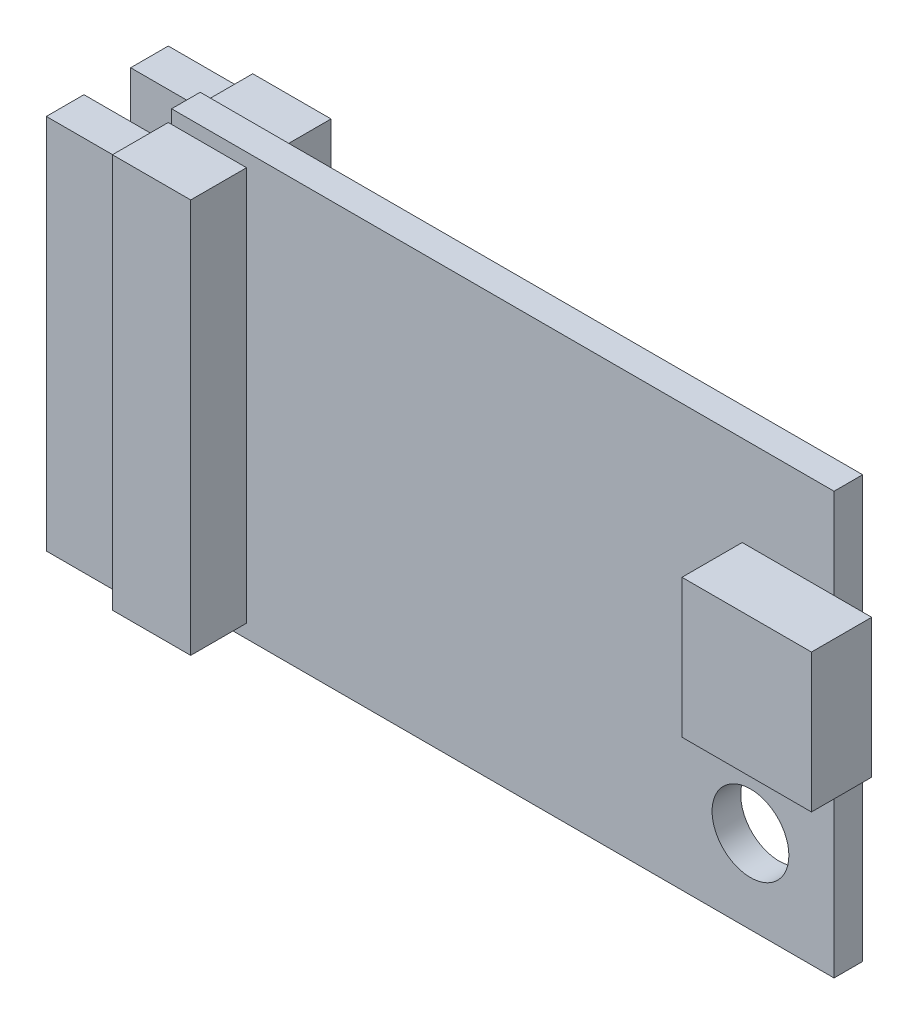
ISO-10303-21;
HEADER;
FILE_DESCRIPTION(('STEP AP214'),'2;1');
FILE_NAME('part.step','',(''),(''),'','','');
FILE_SCHEMA(('AUTOMOTIVE_DESIGN { 1 0 10303 214 1 1 1 1 }'));
ENDSEC;
DATA;
#1=APPLICATION_CONTEXT('core data for automotive mechanical design processes');
#2=APPLICATION_PROTOCOL_DEFINITION('international standard','automotive_design',2000,#1);
#3=PRODUCT_CONTEXT('',#1,'mechanical');
#4=PRODUCT('Part','Part','',(#3));
#5=PRODUCT_RELATED_PRODUCT_CATEGORY('part','',(#4));
#6=PRODUCT_DEFINITION_FORMATION('','',#4);
#7=PRODUCT_DEFINITION_CONTEXT('part definition',#1,'design');
#8=PRODUCT_DEFINITION('design','',#6,#7);
#9=PRODUCT_DEFINITION_SHAPE('','',#8);
#10=(LENGTH_UNIT() NAMED_UNIT(*) SI_UNIT(.MILLI.,.METRE.));
#11=(NAMED_UNIT(*) PLANE_ANGLE_UNIT() SI_UNIT($,.RADIAN.));
#12=(NAMED_UNIT(*) SI_UNIT($,.STERADIAN.) SOLID_ANGLE_UNIT());
#13=UNCERTAINTY_MEASURE_WITH_UNIT(LENGTH_MEASURE(1.E-05),#10,'distance_accuracy_value','');
#14=(GEOMETRIC_REPRESENTATION_CONTEXT(3) GLOBAL_UNCERTAINTY_ASSIGNED_CONTEXT((#13)) GLOBAL_UNIT_ASSIGNED_CONTEXT((#10,
#11,#12)) REPRESENTATION_CONTEXT('',''));
#15=CARTESIAN_POINT('',(0.,0.,0.));
#16=DIRECTION('',(0.,0.,1.));
#17=DIRECTION('',(1.,0.,0.));
#18=AXIS2_PLACEMENT_3D('',#15,#16,#17);
#19=CARTESIAN_POINT('',(0.,0.,0.475));
#20=DIRECTION('',(0.,0.,1.));
#21=DIRECTION('',(1.,0.,0.));
#22=AXIS2_PLACEMENT_3D('',#19,#20,#21);
#23=PLANE('',#22);
#24=CARTESIAN_POINT('',(8.225,-4.225,0.475));
#25=DIRECTION('',(0.,0.,1.));
#26=DIRECTION('',(1.,0.,0.));
#27=AXIS2_PLACEMENT_3D('',#24,#25,#26);
#28=CIRCLE('',#27,1.275);
#29=CARTESIAN_POINT('',(9.50000000000001,-4.225,0.475));
#30=VERTEX_POINT('',#29);
#31=EDGE_CURVE('E370',#30,#30,#28,.T.);
#32=ORIENTED_EDGE('',*,*,#31,.F.);
#33=EDGE_LOOP('',(#32));
#34=FACE_BOUND('',#33,.T.);
#35=DIRECTION('',(0.,1.,0.));
#36=VECTOR('',#35,1.);
#37=CARTESIAN_POINT('',(11.,7.,0.475));
#38=LINE('',#37,#36);
#39=CARTESIAN_POINT('',(11.,-7.,0.475));
#40=VERTEX_POINT('',#39);
#41=CARTESIAN_POINT('',(11.,-0.600000000000002,0.475));
#42=VERTEX_POINT('',#41);
#43=EDGE_CURVE('E376',#40,#42,#38,.T.);
#44=ORIENTED_EDGE('',*,*,#43,.T.);
#45=DIRECTION('',(1.,0.,0.));
#46=VECTOR('',#45,1.);
#47=CARTESIAN_POINT('',(12.25,-0.600000000000002,0.475));
#48=LINE('',#47,#46);
#49=CARTESIAN_POINT('',(7.95000000000001,-0.600000000000002,0.475));
#50=VERTEX_POINT('',#49);
#51=EDGE_CURVE('E50',#50,#42,#48,.T.);
#52=ORIENTED_EDGE('',*,*,#51,.F.);
#53=DIRECTION('',(0.,-1.,0.));
#54=VECTOR('',#53,1.);
#55=CARTESIAN_POINT('',(7.95,4.,0.475));
#56=LINE('',#55,#54);
#57=CARTESIAN_POINT('',(7.95,4.,0.475));
#58=VERTEX_POINT('',#57);
#59=EDGE_CURVE('E55',#58,#50,#56,.T.);
#60=ORIENTED_EDGE('',*,*,#59,.F.);
#61=DIRECTION('',(-1.,0.,0.));
#62=VECTOR('',#61,1.);
#63=CARTESIAN_POINT('',(12.25,4.,0.475));
#64=LINE('',#63,#62);
#65=CARTESIAN_POINT('',(11.,4.,0.475));
#66=VERTEX_POINT('',#65);
#67=EDGE_CURVE('E459',#66,#58,#64,.T.);
#68=ORIENTED_EDGE('',*,*,#67,.F.);
#69=CARTESIAN_POINT('',(11.,7.,0.475));
#70=VERTEX_POINT('',#69);
#71=EDGE_CURVE('E380',#66,#70,#38,.T.);
#72=ORIENTED_EDGE('',*,*,#71,.T.);
#73=DIRECTION('',(-1.,0.,0.));
#74=VECTOR('',#73,1.);
#75=CARTESIAN_POINT('',(-11.,7.,0.475));
#76=LINE('',#75,#74);
#77=CARTESIAN_POINT('',(-11.,7.,0.475));
#78=VERTEX_POINT('',#77);
#79=EDGE_CURVE('E378',#70,#78,#76,.T.);
#80=ORIENTED_EDGE('',*,*,#79,.T.);
#81=DIRECTION('',(0.,-1.,0.));
#82=VECTOR('',#81,1.);
#83=CARTESIAN_POINT('',(-11.,7.,0.475));
#84=LINE('',#83,#82);
#85=CARTESIAN_POINT('',(-11.,6.55,0.475));
#86=VERTEX_POINT('',#85);
#87=EDGE_CURVE('E383',#78,#86,#84,.T.);
#88=ORIENTED_EDGE('',*,*,#87,.T.);
#89=DIRECTION('',(-1.,0.,0.));
#90=VECTOR('',#89,1.);
#91=CARTESIAN_POINT('',(-11.11,6.55,0.475));
#92=LINE('',#91,#90);
#93=CARTESIAN_POINT('',(-8.50999999999999,6.55,0.475));
#94=VERTEX_POINT('',#93);
#95=EDGE_CURVE('E351',#94,#86,#92,.T.);
#96=ORIENTED_EDGE('',*,*,#95,.F.);
#97=DIRECTION('',(0.,1.,0.));
#98=VECTOR('',#97,1.);
#99=CARTESIAN_POINT('',(-8.50999999999999,6.55,0.475));
#100=LINE('',#99,#98);
#101=CARTESIAN_POINT('',(-8.50999999999999,-6.55,0.475));
#102=VERTEX_POINT('',#101);
#103=EDGE_CURVE('E336',#102,#94,#100,.T.);
#104=ORIENTED_EDGE('',*,*,#103,.F.);
#105=DIRECTION('',(1.,0.,0.));
#106=VECTOR('',#105,1.);
#107=CARTESIAN_POINT('',(-11.11,-6.55,0.475));
#108=LINE('',#107,#106);
#109=CARTESIAN_POINT('',(-11.,-6.55,0.475));
#110=VERTEX_POINT('',#109);
#111=EDGE_CURVE('E41',#110,#102,#108,.T.);
#112=ORIENTED_EDGE('',*,*,#111,.F.);
#113=CARTESIAN_POINT('',(-11.,-7.,0.475));
#114=VERTEX_POINT('',#113);
#115=EDGE_CURVE('E382',#110,#114,#84,.T.);
#116=ORIENTED_EDGE('',*,*,#115,.T.);
#117=DIRECTION('',(1.,0.,0.));
#118=VECTOR('',#117,1.);
#119=CARTESIAN_POINT('',(-11.,-7.,0.475));
#120=LINE('',#119,#118);
#121=EDGE_CURVE('E385',#114,#40,#120,.T.);
#122=ORIENTED_EDGE('',*,*,#121,.T.);
#123=EDGE_LOOP('',(#44,#52,#60,#68,#72,#80,#88,#96,#104,#112,#116,#122));
#124=FACE_BOUND('',#123,.T.);
#125=ADVANCED_FACE('F32',(#34,#124),#23,.T.);
#126=CARTESIAN_POINT('',(-11.11,6.55,-2.33));
#127=DIRECTION('',(-1.,0.,0.));
#128=DIRECTION('',(0.,0.,1.));
#129=AXIS2_PLACEMENT_3D('',#126,#127,#128);
#130=PLANE('',#129);
#131=DIRECTION('',(0.,-1.,0.));
#132=VECTOR('',#131,1.);
#133=CARTESIAN_POINT('',(-11.11,6.55,-0.475));
#134=LINE('',#133,#132);
#135=CARTESIAN_POINT('',(-11.11,6.55,-0.475));
#136=VERTEX_POINT('',#135);
#137=CARTESIAN_POINT('',(-11.11,-6.55,-0.475));
#138=VERTEX_POINT('',#137);
#139=EDGE_CURVE('E321',#136,#138,#134,.T.);
#140=ORIENTED_EDGE('',*,*,#139,.F.);
#141=DIRECTION('',(0.,0.,1.));
#142=VECTOR('',#141,1.);
#143=CARTESIAN_POINT('',(-11.11,6.55,-2.33));
#144=LINE('',#143,#142);
#145=CARTESIAN_POINT('',(-11.11,6.55,-2.33));
#146=VERTEX_POINT('',#145);
#147=EDGE_CURVE('E328',#146,#136,#144,.T.);
#148=ORIENTED_EDGE('',*,*,#147,.F.);
#149=DIRECTION('',(0.,-1.,0.));
#150=VECTOR('',#149,1.);
#151=CARTESIAN_POINT('',(-11.11,6.55,-2.33));
#152=LINE('',#151,#150);
#153=CARTESIAN_POINT('',(-11.11,-6.55,-2.33));
#154=VERTEX_POINT('',#153);
#155=EDGE_CURVE('E311',#146,#154,#152,.T.);
#156=ORIENTED_EDGE('',*,*,#155,.T.);
#157=DIRECTION('',(0.,0.,1.));
#158=VECTOR('',#157,1.);
#159=CARTESIAN_POINT('',(-11.11,-6.55,-2.33));
#160=LINE('',#159,#158);
#161=EDGE_CURVE('E331',#154,#138,#160,.T.);
#162=ORIENTED_EDGE('',*,*,#161,.T.);
#163=EDGE_LOOP('',(#140,#148,#156,#162));
#164=FACE_BOUND('',#163,.T.);
#165=DIRECTION('',(0.,0.,1.));
#166=VECTOR('',#165,1.);
#167=CARTESIAN_POINT('',(-11.11,-6.25,-0.774999999999999));
#168=LINE('',#167,#166);
#169=CARTESIAN_POINT('',(-11.11,-6.25,-2.025));
#170=VERTEX_POINT('',#169);
#171=CARTESIAN_POINT('',(-11.11,-6.25,-0.774999999999999));
#172=VERTEX_POINT('',#171);
#173=EDGE_CURVE('E288',#170,#172,#168,.T.);
#174=ORIENTED_EDGE('',*,*,#173,.F.);
#175=DIRECTION('',(0.,-1.,0.));
#176=VECTOR('',#175,1.);
#177=CARTESIAN_POINT('',(-11.11,6.25,-2.025));
#178=LINE('',#177,#176);
#179=CARTESIAN_POINT('',(-11.11,6.25,-2.025));
#180=VERTEX_POINT('',#179);
#181=EDGE_CURVE('E274',#180,#170,#178,.T.);
#182=ORIENTED_EDGE('',*,*,#181,.F.);
#183=DIRECTION('',(0.,0.,-1.));
#184=VECTOR('',#183,1.);
#185=CARTESIAN_POINT('',(-11.11,6.25,-0.775000000000001));
#186=LINE('',#185,#184);
#187=CARTESIAN_POINT('',(-11.11,6.25,-0.775000000000001));
#188=VERTEX_POINT('',#187);
#189=EDGE_CURVE('E279',#188,#180,#186,.T.);
#190=ORIENTED_EDGE('',*,*,#189,.F.);
#191=DIRECTION('',(0.,1.,0.));
#192=VECTOR('',#191,1.);
#193=CARTESIAN_POINT('',(-11.11,6.25,-0.775000000000001));
#194=LINE('',#193,#192);
#195=EDGE_CURVE('E290',#172,#188,#194,.T.);
#196=ORIENTED_EDGE('',*,*,#195,.F.);
#197=EDGE_LOOP('',(#174,#182,#190,#196));
#198=FACE_BOUND('',#197,.T.);
#199=ADVANCED_FACE('F482',(#164,#198),#130,.T.);
#200=CARTESIAN_POINT('',(0.,0.,-0.475));
#201=DIRECTION('',(0.,0.,1.));
#202=DIRECTION('',(1.,0.,0.));
#203=AXIS2_PLACEMENT_3D('',#200,#201,#202);
#204=PLANE('',#203);
#205=DIRECTION('',(0.,1.,0.));
#206=VECTOR('',#205,1.);
#207=CARTESIAN_POINT('',(-8.50999999999999,6.55,-0.475));
#208=LINE('',#207,#206);
#209=CARTESIAN_POINT('',(-8.50999999999999,-6.55,-0.475));
#210=VERTEX_POINT('',#209);
#211=CARTESIAN_POINT('',(-8.50999999999999,6.55,-0.475));
#212=VERTEX_POINT('',#211);
#213=EDGE_CURVE('E303',#210,#212,#208,.T.);
#214=ORIENTED_EDGE('',*,*,#213,.T.);
#215=DIRECTION('',(-1.,0.,0.));
#216=VECTOR('',#215,1.);
#217=CARTESIAN_POINT('',(-11.11,6.55,-0.475));
#218=LINE('',#217,#216);
#219=CARTESIAN_POINT('',(-11.,6.55,-0.475));
#220=VERTEX_POINT('',#219);
#221=EDGE_CURVE('E308',#212,#220,#218,.T.);
#222=ORIENTED_EDGE('',*,*,#221,.T.);
#223=DIRECTION('',(0.,-1.,0.));
#224=VECTOR('',#223,1.);
#225=CARTESIAN_POINT('',(-11.,7.,-0.475));
#226=LINE('',#225,#224);
#227=CARTESIAN_POINT('',(-11.,7.,-0.475));
#228=VERTEX_POINT('',#227);
#229=EDGE_CURVE('E394',#228,#220,#226,.T.);
#230=ORIENTED_EDGE('',*,*,#229,.F.);
#231=DIRECTION('',(-1.,0.,0.));
#232=VECTOR('',#231,1.);
#233=CARTESIAN_POINT('',(-11.,7.,-0.475));
#234=LINE('',#233,#232);
#235=CARTESIAN_POINT('',(11.,7.,-0.475));
#236=VERTEX_POINT('',#235);
#237=EDGE_CURVE('E391',#236,#228,#234,.T.);
#238=ORIENTED_EDGE('',*,*,#237,.F.);
#239=DIRECTION('',(0.,1.,0.));
#240=VECTOR('',#239,1.);
#241=CARTESIAN_POINT('',(11.,7.,-0.475));
#242=LINE('',#241,#240);
#243=CARTESIAN_POINT('',(11.,-7.,-0.475));
#244=VERTEX_POINT('',#243);
#245=EDGE_CURVE('E373',#244,#236,#242,.T.);
#246=ORIENTED_EDGE('',*,*,#245,.F.);
#247=DIRECTION('',(1.,0.,0.));
#248=VECTOR('',#247,1.);
#249=CARTESIAN_POINT('',(-11.,-7.,-0.475));
#250=LINE('',#249,#248);
#251=CARTESIAN_POINT('',(-11.,-7.,-0.475));
#252=VERTEX_POINT('',#251);
#253=EDGE_CURVE('E397',#252,#244,#250,.T.);
#254=ORIENTED_EDGE('',*,*,#253,.F.);
#255=CARTESIAN_POINT('',(-11.,-6.55,-0.475));
#256=VERTEX_POINT('',#255);
#257=EDGE_CURVE('E393',#256,#252,#226,.T.);
#258=ORIENTED_EDGE('',*,*,#257,.F.);
#259=DIRECTION('',(1.,0.,0.));
#260=VECTOR('',#259,1.);
#261=CARTESIAN_POINT('',(-11.11,-6.55,-0.475));
#262=LINE('',#261,#260);
#263=EDGE_CURVE('E11',#256,#210,#262,.T.);
#264=ORIENTED_EDGE('',*,*,#263,.T.);
#265=EDGE_LOOP('',(#214,#222,#230,#238,#246,#254,#258,#264));
#266=FACE_BOUND('',#265,.T.);
#267=CARTESIAN_POINT('',(8.225,-4.225,-0.475));
#268=DIRECTION('',(0.,0.,1.));
#269=DIRECTION('',(1.,0.,0.));
#270=AXIS2_PLACEMENT_3D('',#267,#268,#269);
#271=CIRCLE('',#270,1.275);
#272=CARTESIAN_POINT('',(9.50000000000001,-4.225,-0.475));
#273=VERTEX_POINT('',#272);
#274=EDGE_CURVE('E369',#273,#273,#271,.T.);
#275=ORIENTED_EDGE('',*,*,#274,.T.);
#276=EDGE_LOOP('',(#275));
#277=FACE_BOUND('',#276,.T.);
#278=ADVANCED_FACE('F488',(#266,#277),#204,.F.);
#279=CARTESIAN_POINT('',(11.,7.,0.475));
#280=DIRECTION('',(-1.,0.,0.));
#281=DIRECTION('',(0.,0.,1.));
#282=AXIS2_PLACEMENT_3D('',#279,#280,#281);
#283=PLANE('',#282);
#284=ORIENTED_EDGE('',*,*,#245,.T.);
#285=DIRECTION('',(0.,0.,-1.));
#286=VECTOR('',#285,1.);
#287=CARTESIAN_POINT('',(11.,7.,0.475));
#288=LINE('',#287,#286);
#289=EDGE_CURVE('E36',#70,#236,#288,.T.);
#290=ORIENTED_EDGE('',*,*,#289,.F.);
#291=ORIENTED_EDGE('',*,*,#71,.F.);
#292=EDGE_CURVE('E379',#42,#66,#38,.T.);
#293=ORIENTED_EDGE('',*,*,#292,.F.);
#294=ORIENTED_EDGE('',*,*,#43,.F.);
#295=DIRECTION('',(0.,0.,-1.));
#296=VECTOR('',#295,1.);
#297=CARTESIAN_POINT('',(11.,-7.,0.475));
#298=LINE('',#297,#296);
#299=EDGE_CURVE('E388',#40,#244,#298,.T.);
#300=ORIENTED_EDGE('',*,*,#299,.T.);
#301=EDGE_LOOP('',(#284,#290,#291,#293,#294,#300));
#302=FACE_BOUND('',#301,.T.);
#303=ADVANCED_FACE('F34',(#302),#283,.F.);
#304=CARTESIAN_POINT('',(-11.,7.,0.475));
#305=DIRECTION('',(0.,-1.,0.));
#306=DIRECTION('',(0.,0.,-1.));
#307=AXIS2_PLACEMENT_3D('',#304,#305,#306);
#308=PLANE('',#307);
#309=ORIENTED_EDGE('',*,*,#237,.T.);
#310=DIRECTION('',(0.,0.,-1.));
#311=VECTOR('',#310,1.);
#312=CARTESIAN_POINT('',(-11.,7.,0.475));
#313=LINE('',#312,#311);
#314=EDGE_CURVE('E404',#78,#228,#313,.T.);
#315=ORIENTED_EDGE('',*,*,#314,.F.);
#316=ORIENTED_EDGE('',*,*,#79,.F.);
#317=ORIENTED_EDGE('',*,*,#289,.T.);
#318=EDGE_LOOP('',(#309,#315,#316,#317));
#319=FACE_BOUND('',#318,.T.);
#320=ADVANCED_FACE('F502',(#319),#308,.F.);
#321=CARTESIAN_POINT('',(-11.,7.,0.475));
#322=DIRECTION('',(1.,0.,0.));
#323=DIRECTION('',(0.,0.,-1.));
#324=AXIS2_PLACEMENT_3D('',#321,#322,#323);
#325=PLANE('',#324);
#326=ORIENTED_EDGE('',*,*,#229,.T.);
#327=EDGE_CURVE('E398',#220,#256,#226,.T.);
#328=ORIENTED_EDGE('',*,*,#327,.T.);
#329=ORIENTED_EDGE('',*,*,#257,.T.);
#330=DIRECTION('',(0.,0.,-1.));
#331=VECTOR('',#330,1.);
#332=CARTESIAN_POINT('',(-11.,-7.,0.475));
#333=LINE('',#332,#331);
#334=EDGE_CURVE('E402',#114,#252,#333,.T.);
#335=ORIENTED_EDGE('',*,*,#334,.F.);
#336=ORIENTED_EDGE('',*,*,#115,.F.);
#337=EDGE_CURVE('E386',#86,#110,#84,.T.);
#338=ORIENTED_EDGE('',*,*,#337,.F.);
#339=ORIENTED_EDGE('',*,*,#87,.F.);
#340=ORIENTED_EDGE('',*,*,#314,.T.);
#341=EDGE_LOOP('',(#326,#328,#329,#335,#336,#338,#339,#340));
#342=FACE_BOUND('',#341,.T.);
#343=ADVANCED_FACE('F440',(#342),#325,.F.);
#344=CARTESIAN_POINT('',(-11.,-7.,0.475));
#345=DIRECTION('',(0.,1.,0.));
#346=DIRECTION('',(0.,0.,1.));
#347=AXIS2_PLACEMENT_3D('',#344,#345,#346);
#348=PLANE('',#347);
#349=ORIENTED_EDGE('',*,*,#253,.T.);
#350=ORIENTED_EDGE('',*,*,#299,.F.);
#351=ORIENTED_EDGE('',*,*,#121,.F.);
#352=ORIENTED_EDGE('',*,*,#334,.T.);
#353=EDGE_LOOP('',(#349,#350,#351,#352));
#354=FACE_BOUND('',#353,.T.);
#355=ADVANCED_FACE('F445',(#354),#348,.F.);
#356=CARTESIAN_POINT('',(8.225,-4.225,0.475));
#357=DIRECTION('',(0.,0.,-1.));
#358=DIRECTION('',(-1.,0.,0.));
#359=AXIS2_PLACEMENT_3D('',#356,#357,#358);
#360=CYLINDRICAL_SURFACE('',#359,1.275);
#361=ORIENTED_EDGE('',*,*,#31,.T.);
#362=EDGE_LOOP('',(#361));
#363=FACE_BOUND('',#362,.T.);
#364=ORIENTED_EDGE('',*,*,#274,.F.);
#365=EDGE_LOOP('',(#364));
#366=FACE_BOUND('',#365,.T.);
#367=ADVANCED_FACE('F494',(#363,#366),#360,.F.);
#368=CARTESIAN_POINT('',(0.,0.,0.475));
#369=DIRECTION('',(0.,0.,1.));
#370=DIRECTION('',(1.,0.,0.));
#371=AXIS2_PLACEMENT_3D('',#368,#369,#370);
#372=PLANE('',#371);
#373=CARTESIAN_POINT('',(-11.11,6.55,0.475));
#374=VERTEX_POINT('',#373);
#375=EDGE_CURVE('E350',#86,#374,#92,.T.);
#376=ORIENTED_EDGE('',*,*,#375,.F.);
#377=ORIENTED_EDGE('',*,*,#337,.T.);
#378=CARTESIAN_POINT('',(-11.11,-6.55,0.475));
#379=VERTEX_POINT('',#378);
#380=EDGE_CURVE('E341',#379,#110,#108,.T.);
#381=ORIENTED_EDGE('',*,*,#380,.F.);
#382=DIRECTION('',(0.,-1.,0.));
#383=VECTOR('',#382,1.);
#384=CARTESIAN_POINT('',(-11.11,6.55,0.475));
#385=LINE('',#384,#383);
#386=EDGE_CURVE('E354',#374,#379,#385,.T.);
#387=ORIENTED_EDGE('',*,*,#386,.F.);
#388=EDGE_LOOP('',(#376,#377,#381,#387));
#389=FACE_BOUND('',#388,.T.);
#390=ADVANCED_FACE('F435',(#389),#372,.F.);
#391=CARTESIAN_POINT('',(-8.50999999999999,6.55,2.33));
#392=DIRECTION('',(-1.,0.,0.));
#393=DIRECTION('',(0.,0.,1.));
#394=AXIS2_PLACEMENT_3D('',#391,#392,#393);
#395=PLANE('',#394);
#396=ORIENTED_EDGE('',*,*,#103,.T.);
#397=DIRECTION('',(0.,0.,-1.));
#398=VECTOR('',#397,1.);
#399=CARTESIAN_POINT('',(-8.50999999999999,6.55,2.33));
#400=LINE('',#399,#398);
#401=CARTESIAN_POINT('',(-8.50999999999999,6.55,2.33));
#402=VERTEX_POINT('',#401);
#403=EDGE_CURVE('E366',#402,#94,#400,.T.);
#404=ORIENTED_EDGE('',*,*,#403,.F.);
#405=DIRECTION('',(0.,1.,0.));
#406=VECTOR('',#405,1.);
#407=CARTESIAN_POINT('',(-8.50999999999999,6.55,2.33));
#408=LINE('',#407,#406);
#409=CARTESIAN_POINT('',(-8.50999999999999,-6.55,2.33));
#410=VERTEX_POINT('',#409);
#411=EDGE_CURVE('E337',#410,#402,#408,.T.);
#412=ORIENTED_EDGE('',*,*,#411,.F.);
#413=DIRECTION('',(0.,0.,-1.));
#414=VECTOR('',#413,1.);
#415=CARTESIAN_POINT('',(-8.50999999999999,-6.55,2.33));
#416=LINE('',#415,#414);
#417=EDGE_CURVE('E347',#410,#102,#416,.T.);
#418=ORIENTED_EDGE('',*,*,#417,.T.);
#419=EDGE_LOOP('',(#396,#404,#412,#418));
#420=FACE_BOUND('',#419,.T.);
#421=ADVANCED_FACE('F423',(#420),#395,.F.);
#422=CARTESIAN_POINT('',(-11.11,6.55,2.33));
#423=DIRECTION('',(0.,-1.,0.));
#424=DIRECTION('',(0.,0.,-1.));
#425=AXIS2_PLACEMENT_3D('',#422,#423,#424);
#426=PLANE('',#425);
#427=ORIENTED_EDGE('',*,*,#95,.T.);
#428=ORIENTED_EDGE('',*,*,#375,.T.);
#429=DIRECTION('',(0.,0.,-1.));
#430=VECTOR('',#429,1.);
#431=CARTESIAN_POINT('',(-11.11,6.55,2.33));
#432=LINE('',#431,#430);
#433=CARTESIAN_POINT('',(-11.11,6.55,2.33));
#434=VERTEX_POINT('',#433);
#435=EDGE_CURVE('E363',#434,#374,#432,.T.);
#436=ORIENTED_EDGE('',*,*,#435,.F.);
#437=DIRECTION('',(-1.,0.,0.));
#438=VECTOR('',#437,1.);
#439=CARTESIAN_POINT('',(-11.11,6.55,2.33));
#440=LINE('',#439,#438);
#441=EDGE_CURVE('E340',#402,#434,#440,.T.);
#442=ORIENTED_EDGE('',*,*,#441,.F.);
#443=ORIENTED_EDGE('',*,*,#403,.T.);
#444=EDGE_LOOP('',(#427,#428,#436,#442,#443));
#445=FACE_BOUND('',#444,.T.);
#446=ADVANCED_FACE('F552',(#445),#426,.F.);
#447=CARTESIAN_POINT('',(-11.11,6.55,2.33));
#448=DIRECTION('',(1.,0.,0.));
#449=DIRECTION('',(0.,0.,-1.));
#450=AXIS2_PLACEMENT_3D('',#447,#448,#449);
#451=PLANE('',#450);
#452=DIRECTION('',(0.,0.,1.));
#453=VECTOR('',#452,1.);
#454=CARTESIAN_POINT('',(-11.11,6.25,0.775000000000001));
#455=LINE('',#454,#453);
#456=CARTESIAN_POINT('',(-11.11,6.25,0.775000000000001));
#457=VERTEX_POINT('',#456);
#458=CARTESIAN_POINT('',(-11.11,6.25,2.025));
#459=VERTEX_POINT('',#458);
#460=EDGE_CURVE('E239',#457,#459,#455,.T.);
#461=ORIENTED_EDGE('',*,*,#460,.T.);
#462=DIRECTION('',(0.,-1.,0.));
#463=VECTOR('',#462,1.);
#464=CARTESIAN_POINT('',(-11.11,6.25,2.025));
#465=LINE('',#464,#463);
#466=CARTESIAN_POINT('',(-11.11,-6.25,2.025));
#467=VERTEX_POINT('',#466);
#468=EDGE_CURVE('E236',#459,#467,#465,.T.);
#469=ORIENTED_EDGE('',*,*,#468,.T.);
#470=DIRECTION('',(0.,0.,-1.));
#471=VECTOR('',#470,1.);
#472=CARTESIAN_POINT('',(-11.11,-6.25,0.774999999999999));
#473=LINE('',#472,#471);
#474=CARTESIAN_POINT('',(-11.11,-6.25,0.774999999999999));
#475=VERTEX_POINT('',#474);
#476=EDGE_CURVE('E249',#467,#475,#473,.T.);
#477=ORIENTED_EDGE('',*,*,#476,.T.);
#478=DIRECTION('',(0.,1.,0.));
#479=VECTOR('',#478,1.);
#480=CARTESIAN_POINT('',(-11.11,6.25,0.775000000000001));
#481=LINE('',#480,#479);
#482=EDGE_CURVE('E261',#475,#457,#481,.T.);
#483=ORIENTED_EDGE('',*,*,#482,.T.);
#484=EDGE_LOOP('',(#461,#469,#477,#483));
#485=FACE_BOUND('',#484,.T.);
#486=ORIENTED_EDGE('',*,*,#386,.T.);
#487=DIRECTION('',(0.,0.,-1.));
#488=VECTOR('',#487,1.);
#489=CARTESIAN_POINT('',(-11.11,-6.55,2.33));
#490=LINE('',#489,#488);
#491=CARTESIAN_POINT('',(-11.11,-6.55,2.33));
#492=VERTEX_POINT('',#491);
#493=EDGE_CURVE('E360',#492,#379,#490,.T.);
#494=ORIENTED_EDGE('',*,*,#493,.F.);
#495=DIRECTION('',(0.,-1.,0.));
#496=VECTOR('',#495,1.);
#497=CARTESIAN_POINT('',(-11.11,6.55,2.33));
#498=LINE('',#497,#496);
#499=EDGE_CURVE('E343',#434,#492,#498,.T.);
#500=ORIENTED_EDGE('',*,*,#499,.F.);
#501=ORIENTED_EDGE('',*,*,#435,.T.);
#502=EDGE_LOOP('',(#486,#494,#500,#501));
#503=FACE_BOUND('',#502,.T.);
#504=ADVANCED_FACE('F549',(#485,#503),#451,.F.);
#505=CARTESIAN_POINT('',(-11.11,-6.55,2.33));
#506=DIRECTION('',(0.,1.,0.));
#507=DIRECTION('',(0.,0.,1.));
#508=AXIS2_PLACEMENT_3D('',#505,#506,#507);
#509=PLANE('',#508);
#510=ORIENTED_EDGE('',*,*,#380,.T.);
#511=ORIENTED_EDGE('',*,*,#111,.T.);
#512=ORIENTED_EDGE('',*,*,#417,.F.);
#513=DIRECTION('',(1.,0.,0.));
#514=VECTOR('',#513,1.);
#515=CARTESIAN_POINT('',(-11.11,-6.55,2.33));
#516=LINE('',#515,#514);
#517=EDGE_CURVE('E345',#492,#410,#516,.T.);
#518=ORIENTED_EDGE('',*,*,#517,.F.);
#519=ORIENTED_EDGE('',*,*,#493,.T.);
#520=EDGE_LOOP('',(#510,#511,#512,#518,#519));
#521=FACE_BOUND('',#520,.T.);
#522=ADVANCED_FACE('F417',(#521),#509,.F.);
#523=CARTESIAN_POINT('',(0.,0.,2.33));
#524=DIRECTION('',(0.,0.,1.));
#525=DIRECTION('',(1.,0.,0.));
#526=AXIS2_PLACEMENT_3D('',#523,#524,#525);
#527=PLANE('',#526);
#528=ORIENTED_EDGE('',*,*,#411,.T.);
#529=ORIENTED_EDGE('',*,*,#441,.T.);
#530=ORIENTED_EDGE('',*,*,#499,.T.);
#531=ORIENTED_EDGE('',*,*,#517,.T.);
#532=EDGE_LOOP('',(#528,#529,#530,#531));
#533=FACE_BOUND('',#532,.T.);
#534=ADVANCED_FACE('F426',(#533),#527,.T.);
#535=CARTESIAN_POINT('',(-8.50999999999999,6.55,-2.33));
#536=DIRECTION('',(1.,0.,0.));
#537=DIRECTION('',(0.,0.,-1.));
#538=AXIS2_PLACEMENT_3D('',#535,#536,#537);
#539=PLANE('',#538);
#540=ORIENTED_EDGE('',*,*,#213,.F.);
#541=DIRECTION('',(0.,0.,1.));
#542=VECTOR('',#541,1.);
#543=CARTESIAN_POINT('',(-8.50999999999999,-6.55,-2.33));
#544=LINE('',#543,#542);
#545=CARTESIAN_POINT('',(-8.50999999999999,-6.55,-2.33));
#546=VERTEX_POINT('',#545);
#547=EDGE_CURVE('E333',#546,#210,#544,.T.);
#548=ORIENTED_EDGE('',*,*,#547,.F.);
#549=DIRECTION('',(0.,1.,0.));
#550=VECTOR('',#549,1.);
#551=CARTESIAN_POINT('',(-8.50999999999999,6.55,-2.33));
#552=LINE('',#551,#550);
#553=CARTESIAN_POINT('',(-8.50999999999999,6.55,-2.33));
#554=VERTEX_POINT('',#553);
#555=EDGE_CURVE('E304',#546,#554,#552,.T.);
#556=ORIENTED_EDGE('',*,*,#555,.T.);
#557=DIRECTION('',(0.,0.,1.));
#558=VECTOR('',#557,1.);
#559=CARTESIAN_POINT('',(-8.50999999999999,6.55,-2.33));
#560=LINE('',#559,#558);
#561=EDGE_CURVE('E317',#554,#212,#560,.T.);
#562=ORIENTED_EDGE('',*,*,#561,.T.);
#563=EDGE_LOOP('',(#540,#548,#556,#562));
#564=FACE_BOUND('',#563,.T.);
#565=ADVANCED_FACE('F523',(#564),#539,.T.);
#566=CARTESIAN_POINT('',(-11.11,-6.55,-2.33));
#567=DIRECTION('',(0.,-1.,0.));
#568=DIRECTION('',(0.,0.,-1.));
#569=AXIS2_PLACEMENT_3D('',#566,#567,#568);
#570=PLANE('',#569);
#571=EDGE_CURVE('E43',#138,#256,#262,.T.);
#572=ORIENTED_EDGE('',*,*,#571,.F.);
#573=ORIENTED_EDGE('',*,*,#161,.F.);
#574=DIRECTION('',(1.,0.,0.));
#575=VECTOR('',#574,1.);
#576=CARTESIAN_POINT('',(-11.11,-6.55,-2.33));
#577=LINE('',#576,#575);
#578=EDGE_CURVE('E307',#154,#546,#577,.T.);
#579=ORIENTED_EDGE('',*,*,#578,.T.);
#580=ORIENTED_EDGE('',*,*,#547,.T.);
#581=ORIENTED_EDGE('',*,*,#263,.F.);
#582=EDGE_LOOP('',(#572,#573,#579,#580,#581));
#583=FACE_BOUND('',#582,.T.);
#584=ADVANCED_FACE('F521',(#583),#570,.T.);
#585=CARTESIAN_POINT('',(-11.11,6.55,-2.33));
#586=DIRECTION('',(0.,1.,0.));
#587=DIRECTION('',(0.,0.,1.));
#588=AXIS2_PLACEMENT_3D('',#585,#586,#587);
#589=PLANE('',#588);
#590=ORIENTED_EDGE('',*,*,#221,.F.);
#591=ORIENTED_EDGE('',*,*,#561,.F.);
#592=DIRECTION('',(-1.,0.,0.));
#593=VECTOR('',#592,1.);
#594=CARTESIAN_POINT('',(-11.11,6.55,-2.33));
#595=LINE('',#594,#593);
#596=EDGE_CURVE('E314',#554,#146,#595,.T.);
#597=ORIENTED_EDGE('',*,*,#596,.T.);
#598=ORIENTED_EDGE('',*,*,#147,.T.);
#599=EDGE_CURVE('E324',#220,#136,#218,.T.);
#600=ORIENTED_EDGE('',*,*,#599,.F.);
#601=EDGE_LOOP('',(#590,#591,#597,#598,#600));
#602=FACE_BOUND('',#601,.T.);
#603=ADVANCED_FACE('F514',(#602),#589,.T.);
#604=CARTESIAN_POINT('',(0.,0.,-2.33));
#605=DIRECTION('',(0.,0.,-1.));
#606=DIRECTION('',(1.,0.,0.));
#607=AXIS2_PLACEMENT_3D('',#604,#605,#606);
#608=PLANE('',#607);
#609=ORIENTED_EDGE('',*,*,#555,.F.);
#610=ORIENTED_EDGE('',*,*,#578,.F.);
#611=ORIENTED_EDGE('',*,*,#155,.F.);
#612=ORIENTED_EDGE('',*,*,#596,.F.);
#613=EDGE_LOOP('',(#609,#610,#611,#612));
#614=FACE_BOUND('',#613,.T.);
#615=ADVANCED_FACE('F526',(#614),#608,.T.);
#616=CARTESIAN_POINT('',(0.,0.,-0.475));
#617=DIRECTION('',(0.,0.,-1.));
#618=DIRECTION('',(1.,0.,0.));
#619=AXIS2_PLACEMENT_3D('',#616,#617,#618);
#620=PLANE('',#619);
#621=ORIENTED_EDGE('',*,*,#327,.F.);
#622=ORIENTED_EDGE('',*,*,#599,.T.);
#623=ORIENTED_EDGE('',*,*,#139,.T.);
#624=ORIENTED_EDGE('',*,*,#571,.T.);
#625=EDGE_LOOP('',(#621,#622,#623,#624));
#626=FACE_BOUND('',#625,.T.);
#627=ADVANCED_FACE('F511',(#626),#620,.F.);
#628=CARTESIAN_POINT('',(-13.61,6.25,-2.025));
#629=DIRECTION('',(0.,0.,1.));
#630=DIRECTION('',(0.,-1.,0.));
#631=AXIS2_PLACEMENT_3D('',#628,#629,#630);
#632=PLANE('',#631);
#633=ORIENTED_EDGE('',*,*,#181,.T.);
#634=DIRECTION('',(1.,0.,0.));
#635=VECTOR('',#634,1.);
#636=CARTESIAN_POINT('',(-13.61,-6.25,-2.025));
#637=LINE('',#636,#635);
#638=CARTESIAN_POINT('',(-13.61,-6.25,-2.025));
#639=VERTEX_POINT('',#638);
#640=EDGE_CURVE('E301',#639,#170,#637,.T.);
#641=ORIENTED_EDGE('',*,*,#640,.F.);
#642=DIRECTION('',(0.,-1.,0.));
#643=VECTOR('',#642,1.);
#644=CARTESIAN_POINT('',(-13.61,6.25,-2.025));
#645=LINE('',#644,#643);
#646=CARTESIAN_POINT('',(-13.61,6.25,-2.025));
#647=VERTEX_POINT('',#646);
#648=EDGE_CURVE('E275',#647,#639,#645,.T.);
#649=ORIENTED_EDGE('',*,*,#648,.F.);
#650=DIRECTION('',(1.,0.,0.));
#651=VECTOR('',#650,1.);
#652=CARTESIAN_POINT('',(-13.61,6.25,-2.025));
#653=LINE('',#652,#651);
#654=EDGE_CURVE('E285',#647,#180,#653,.T.);
#655=ORIENTED_EDGE('',*,*,#654,.T.);
#656=EDGE_LOOP('',(#633,#641,#649,#655));
#657=FACE_BOUND('',#656,.T.);
#658=ADVANCED_FACE('F533',(#657),#632,.F.);
#659=CARTESIAN_POINT('',(-13.61,-6.25,-0.774999999999999));
#660=DIRECTION('',(0.,1.,0.));
#661=DIRECTION('',(0.,0.,1.));
#662=AXIS2_PLACEMENT_3D('',#659,#660,#661);
#663=PLANE('',#662);
#664=ORIENTED_EDGE('',*,*,#173,.T.);
#665=DIRECTION('',(1.,0.,0.));
#666=VECTOR('',#665,1.);
#667=CARTESIAN_POINT('',(-13.61,-6.25,-0.774999999999999));
#668=LINE('',#667,#666);
#669=CARTESIAN_POINT('',(-13.61,-6.25,-0.774999999999999));
#670=VERTEX_POINT('',#669);
#671=EDGE_CURVE('E298',#670,#172,#668,.T.);
#672=ORIENTED_EDGE('',*,*,#671,.F.);
#673=DIRECTION('',(0.,0.,1.));
#674=VECTOR('',#673,1.);
#675=CARTESIAN_POINT('',(-13.61,-6.25,-0.774999999999999));
#676=LINE('',#675,#674);
#677=EDGE_CURVE('E278',#639,#670,#676,.T.);
#678=ORIENTED_EDGE('',*,*,#677,.F.);
#679=ORIENTED_EDGE('',*,*,#640,.T.);
#680=EDGE_LOOP('',(#664,#672,#678,#679));
#681=FACE_BOUND('',#680,.T.);
#682=ADVANCED_FACE('F619',(#681),#663,.F.);
#683=CARTESIAN_POINT('',(-13.61,6.25,-0.775000000000001));
#684=DIRECTION('',(0.,0.,-1.));
#685=DIRECTION('',(0.,1.,0.));
#686=AXIS2_PLACEMENT_3D('',#683,#684,#685);
#687=PLANE('',#686);
#688=ORIENTED_EDGE('',*,*,#195,.T.);
#689=DIRECTION('',(1.,0.,0.));
#690=VECTOR('',#689,1.);
#691=CARTESIAN_POINT('',(-13.61,6.25,-0.775000000000001));
#692=LINE('',#691,#690);
#693=CARTESIAN_POINT('',(-13.61,6.25,-0.775000000000001));
#694=VERTEX_POINT('',#693);
#695=EDGE_CURVE('E296',#694,#188,#692,.T.);
#696=ORIENTED_EDGE('',*,*,#695,.F.);
#697=DIRECTION('',(0.,1.,0.));
#698=VECTOR('',#697,1.);
#699=CARTESIAN_POINT('',(-13.61,6.25,-0.775000000000001));
#700=LINE('',#699,#698);
#701=EDGE_CURVE('E281',#670,#694,#700,.T.);
#702=ORIENTED_EDGE('',*,*,#701,.F.);
#703=ORIENTED_EDGE('',*,*,#671,.T.);
#704=EDGE_LOOP('',(#688,#696,#702,#703));
#705=FACE_BOUND('',#704,.T.);
#706=ADVANCED_FACE('F628',(#705),#687,.F.);
#707=CARTESIAN_POINT('',(-13.61,6.25,-0.775000000000001));
#708=DIRECTION('',(0.,-1.,0.));
#709=DIRECTION('',(0.,0.,-1.));
#710=AXIS2_PLACEMENT_3D('',#707,#708,#709);
#711=PLANE('',#710);
#712=ORIENTED_EDGE('',*,*,#189,.T.);
#713=ORIENTED_EDGE('',*,*,#654,.F.);
#714=DIRECTION('',(0.,0.,-1.));
#715=VECTOR('',#714,1.);
#716=CARTESIAN_POINT('',(-13.61,6.25,-0.775000000000001));
#717=LINE('',#716,#715);
#718=EDGE_CURVE('E283',#694,#647,#717,.T.);
#719=ORIENTED_EDGE('',*,*,#718,.F.);
#720=ORIENTED_EDGE('',*,*,#695,.T.);
#721=EDGE_LOOP('',(#712,#713,#719,#720));
#722=FACE_BOUND('',#721,.T.);
#723=ADVANCED_FACE('F637',(#722),#711,.F.);
#724=CARTESIAN_POINT('',(-13.61,0.,0.));
#725=DIRECTION('',(1.,0.,0.));
#726=DIRECTION('',(0.,0.,-1.));
#727=AXIS2_PLACEMENT_3D('',#724,#725,#726);
#728=PLANE('',#727);
#729=ORIENTED_EDGE('',*,*,#648,.T.);
#730=ORIENTED_EDGE('',*,*,#677,.T.);
#731=ORIENTED_EDGE('',*,*,#701,.T.);
#732=ORIENTED_EDGE('',*,*,#718,.T.);
#733=EDGE_LOOP('',(#729,#730,#731,#732));
#734=FACE_BOUND('',#733,.T.);
#735=ADVANCED_FACE('F646',(#734),#728,.F.);
#736=CARTESIAN_POINT('',(-13.61,6.25,2.025));
#737=DIRECTION('',(0.,0.,1.));
#738=DIRECTION('',(0.,-1.,0.));
#739=AXIS2_PLACEMENT_3D('',#736,#737,#738);
#740=PLANE('',#739);
#741=ORIENTED_EDGE('',*,*,#468,.F.);
#742=DIRECTION('',(1.,0.,0.));
#743=VECTOR('',#742,1.);
#744=CARTESIAN_POINT('',(-13.61,6.25,2.025));
#745=LINE('',#744,#743);
#746=CARTESIAN_POINT('',(-13.61,6.25,2.025));
#747=VERTEX_POINT('',#746);
#748=EDGE_CURVE('E272',#747,#459,#745,.T.);
#749=ORIENTED_EDGE('',*,*,#748,.F.);
#750=DIRECTION('',(0.,-1.,0.));
#751=VECTOR('',#750,1.);
#752=CARTESIAN_POINT('',(-13.61,6.25,2.025));
#753=LINE('',#752,#751);
#754=CARTESIAN_POINT('',(-13.61,-6.25,2.025));
#755=VERTEX_POINT('',#754);
#756=EDGE_CURVE('E245',#747,#755,#753,.T.);
#757=ORIENTED_EDGE('',*,*,#756,.T.);
#758=DIRECTION('',(1.,0.,0.));
#759=VECTOR('',#758,1.);
#760=CARTESIAN_POINT('',(-13.61,-6.25,2.025));
#761=LINE('',#760,#759);
#762=EDGE_CURVE('E257',#755,#467,#761,.T.);
#763=ORIENTED_EDGE('',*,*,#762,.T.);
#764=EDGE_LOOP('',(#741,#749,#757,#763));
#765=FACE_BOUND('',#764,.T.);
#766=ADVANCED_FACE('F655',(#765),#740,.T.);
#767=CARTESIAN_POINT('',(-13.61,6.25,0.775000000000001));
#768=DIRECTION('',(0.,1.,0.));
#769=DIRECTION('',(0.,0.,1.));
#770=AXIS2_PLACEMENT_3D('',#767,#768,#769);
#771=PLANE('',#770);
#772=ORIENTED_EDGE('',*,*,#460,.F.);
#773=DIRECTION('',(1.,0.,0.));
#774=VECTOR('',#773,1.);
#775=CARTESIAN_POINT('',(-13.61,6.25,0.775000000000001));
#776=LINE('',#775,#774);
#777=CARTESIAN_POINT('',(-13.61,6.25,0.775000000000001));
#778=VERTEX_POINT('',#777);
#779=EDGE_CURVE('E270',#778,#457,#776,.T.);
#780=ORIENTED_EDGE('',*,*,#779,.F.);
#781=DIRECTION('',(0.,0.,1.));
#782=VECTOR('',#781,1.);
#783=CARTESIAN_POINT('',(-13.61,6.25,0.775000000000001));
#784=LINE('',#783,#782);
#785=EDGE_CURVE('E248',#778,#747,#784,.T.);
#786=ORIENTED_EDGE('',*,*,#785,.T.);
#787=ORIENTED_EDGE('',*,*,#748,.T.);
#788=EDGE_LOOP('',(#772,#780,#786,#787));
#789=FACE_BOUND('',#788,.T.);
#790=ADVANCED_FACE('F665',(#789),#771,.T.);
#791=CARTESIAN_POINT('',(-13.61,6.25,0.775000000000001));
#792=DIRECTION('',(0.,0.,-1.));
#793=DIRECTION('',(0.,1.,0.));
#794=AXIS2_PLACEMENT_3D('',#791,#792,#793);
#795=PLANE('',#794);
#796=ORIENTED_EDGE('',*,*,#482,.F.);
#797=DIRECTION('',(1.,0.,0.));
#798=VECTOR('',#797,1.);
#799=CARTESIAN_POINT('',(-13.61,-6.25,0.774999999999999));
#800=LINE('',#799,#798);
#801=CARTESIAN_POINT('',(-13.61,-6.25,0.774999999999999));
#802=VERTEX_POINT('',#801);
#803=EDGE_CURVE('E267',#802,#475,#800,.T.);
#804=ORIENTED_EDGE('',*,*,#803,.F.);
#805=DIRECTION('',(0.,1.,0.));
#806=VECTOR('',#805,1.);
#807=CARTESIAN_POINT('',(-13.61,6.25,0.775000000000001));
#808=LINE('',#807,#806);
#809=EDGE_CURVE('E252',#802,#778,#808,.T.);
#810=ORIENTED_EDGE('',*,*,#809,.T.);
#811=ORIENTED_EDGE('',*,*,#779,.T.);
#812=EDGE_LOOP('',(#796,#804,#810,#811));
#813=FACE_BOUND('',#812,.T.);
#814=ADVANCED_FACE('F672',(#813),#795,.T.);
#815=CARTESIAN_POINT('',(-13.61,-6.25,0.774999999999999));
#816=DIRECTION('',(0.,-1.,0.));
#817=DIRECTION('',(0.,0.,-1.));
#818=AXIS2_PLACEMENT_3D('',#815,#816,#817);
#819=PLANE('',#818);
#820=ORIENTED_EDGE('',*,*,#476,.F.);
#821=ORIENTED_EDGE('',*,*,#762,.F.);
#822=DIRECTION('',(0.,0.,-1.));
#823=VECTOR('',#822,1.);
#824=CARTESIAN_POINT('',(-13.61,-6.25,0.774999999999999));
#825=LINE('',#824,#823);
#826=EDGE_CURVE('E255',#755,#802,#825,.T.);
#827=ORIENTED_EDGE('',*,*,#826,.T.);
#828=ORIENTED_EDGE('',*,*,#803,.T.);
#829=EDGE_LOOP('',(#820,#821,#827,#828));
#830=FACE_BOUND('',#829,.T.);
#831=ADVANCED_FACE('F680',(#830),#819,.T.);
#832=CARTESIAN_POINT('',(-13.61,0.,0.));
#833=DIRECTION('',(1.,0.,0.));
#834=DIRECTION('',(0.,0.,1.));
#835=AXIS2_PLACEMENT_3D('',#832,#833,#834);
#836=PLANE('',#835);
#837=ORIENTED_EDGE('',*,*,#756,.F.);
#838=ORIENTED_EDGE('',*,*,#785,.F.);
#839=ORIENTED_EDGE('',*,*,#809,.F.);
#840=ORIENTED_EDGE('',*,*,#826,.F.);
#841=EDGE_LOOP('',(#837,#838,#839,#840));
#842=FACE_BOUND('',#841,.T.);
#843=ADVANCED_FACE('F688',(#842),#836,.F.);
#844=CARTESIAN_POINT('',(0.,0.,0.475));
#845=DIRECTION('',(0.,0.,-1.));
#846=DIRECTION('',(-1.,0.,0.));
#847=AXIS2_PLACEMENT_3D('',#844,#845,#846);
#848=PLANE('',#847);
#849=ORIENTED_EDGE('',*,*,#292,.T.);
#850=CARTESIAN_POINT('',(12.25,4.,0.475));
#851=VERTEX_POINT('',#850);
#852=EDGE_CURVE('E233',#851,#66,#64,.T.);
#853=ORIENTED_EDGE('',*,*,#852,.F.);
#854=DIRECTION('',(0.,1.,0.));
#855=VECTOR('',#854,1.);
#856=CARTESIAN_POINT('',(12.25,4.,0.475));
#857=LINE('',#856,#855);
#858=CARTESIAN_POINT('',(12.25,-0.600000000000002,0.475));
#859=VERTEX_POINT('',#858);
#860=EDGE_CURVE('E457',#859,#851,#857,.T.);
#861=ORIENTED_EDGE('',*,*,#860,.F.);
#862=EDGE_CURVE('E453',#42,#859,#48,.T.);
#863=ORIENTED_EDGE('',*,*,#862,.F.);
#864=EDGE_LOOP('',(#849,#853,#861,#863));
#865=FACE_BOUND('',#864,.T.);
#866=ADVANCED_FACE('F454',(#865),#848,.T.);
#867=CARTESIAN_POINT('',(7.95,4.,2.475));
#868=DIRECTION('',(1.,0.,0.));
#869=DIRECTION('',(0.,1.,0.));
#870=AXIS2_PLACEMENT_3D('',#867,#868,#869);
#871=PLANE('',#870);
#872=ORIENTED_EDGE('',*,*,#59,.T.);
#873=DIRECTION('',(0.,0.,-1.));
#874=VECTOR('',#873,1.);
#875=CARTESIAN_POINT('',(7.95000000000001,-0.600000000000002,2.475));
#876=LINE('',#875,#874);
#877=CARTESIAN_POINT('',(7.95000000000001,-0.600000000000002,2.475));
#878=VERTEX_POINT('',#877);
#879=EDGE_CURVE('E218',#878,#50,#876,.T.);
#880=ORIENTED_EDGE('',*,*,#879,.F.);
#881=DIRECTION('',(0.,-1.,0.));
#882=VECTOR('',#881,1.);
#883=CARTESIAN_POINT('',(7.95,4.,2.475));
#884=LINE('',#883,#882);
#885=CARTESIAN_POINT('',(7.95,4.,2.475));
#886=VERTEX_POINT('',#885);
#887=EDGE_CURVE('E224',#886,#878,#884,.T.);
#888=ORIENTED_EDGE('',*,*,#887,.F.);
#889=DIRECTION('',(0.,0.,-1.));
#890=VECTOR('',#889,1.);
#891=CARTESIAN_POINT('',(7.95,4.,2.475));
#892=LINE('',#891,#890);
#893=EDGE_CURVE('E465',#886,#58,#892,.T.);
#894=ORIENTED_EDGE('',*,*,#893,.T.);
#895=EDGE_LOOP('',(#872,#880,#888,#894));
#896=FACE_BOUND('',#895,.T.);
#897=ADVANCED_FACE('F235',(#896),#871,.F.);
#898=CARTESIAN_POINT('',(12.25,-0.600000000000002,2.475));
#899=DIRECTION('',(0.,1.,0.));
#900=DIRECTION('',(-1.,0.,0.));
#901=AXIS2_PLACEMENT_3D('',#898,#899,#900);
#902=PLANE('',#901);
#903=ORIENTED_EDGE('',*,*,#51,.T.);
#904=ORIENTED_EDGE('',*,*,#862,.T.);
#905=DIRECTION('',(0.,0.,-1.));
#906=VECTOR('',#905,1.);
#907=CARTESIAN_POINT('',(12.25,-0.600000000000002,2.475));
#908=LINE('',#907,#906);
#909=CARTESIAN_POINT('',(12.25,-0.600000000000002,2.475));
#910=VERTEX_POINT('',#909);
#911=EDGE_CURVE('E220',#910,#859,#908,.T.);
#912=ORIENTED_EDGE('',*,*,#911,.F.);
#913=DIRECTION('',(1.,0.,0.));
#914=VECTOR('',#913,1.);
#915=CARTESIAN_POINT('',(12.25,-0.600000000000002,2.475));
#916=LINE('',#915,#914);
#917=EDGE_CURVE('E214',#878,#910,#916,.T.);
#918=ORIENTED_EDGE('',*,*,#917,.F.);
#919=ORIENTED_EDGE('',*,*,#879,.T.);
#920=EDGE_LOOP('',(#903,#904,#912,#918,#919));
#921=FACE_BOUND('',#920,.T.);
#922=ADVANCED_FACE('F216',(#921),#902,.F.);
#923=CARTESIAN_POINT('',(12.25,4.,2.475));
#924=DIRECTION('',(-1.,0.,0.));
#925=DIRECTION('',(0.,0.,1.));
#926=AXIS2_PLACEMENT_3D('',#923,#924,#925);
#927=PLANE('',#926);
#928=ORIENTED_EDGE('',*,*,#860,.T.);
#929=DIRECTION('',(0.,0.,-1.));
#930=VECTOR('',#929,1.);
#931=CARTESIAN_POINT('',(12.25,4.,2.475));
#932=LINE('',#931,#930);
#933=CARTESIAN_POINT('',(12.25,4.,2.475));
#934=VERTEX_POINT('',#933);
#935=EDGE_CURVE('E241',#934,#851,#932,.T.);
#936=ORIENTED_EDGE('',*,*,#935,.F.);
#937=DIRECTION('',(0.,1.,0.));
#938=VECTOR('',#937,1.);
#939=CARTESIAN_POINT('',(12.25,4.,2.475));
#940=LINE('',#939,#938);
#941=EDGE_CURVE('E223',#910,#934,#940,.T.);
#942=ORIENTED_EDGE('',*,*,#941,.F.);
#943=ORIENTED_EDGE('',*,*,#911,.T.);
#944=EDGE_LOOP('',(#928,#936,#942,#943));
#945=FACE_BOUND('',#944,.T.);
#946=ADVANCED_FACE('F471',(#945),#927,.F.);
#947=CARTESIAN_POINT('',(12.25,4.,2.475));
#948=DIRECTION('',(0.,-1.,0.));
#949=DIRECTION('',(1.,0.,0.));
#950=AXIS2_PLACEMENT_3D('',#947,#948,#949);
#951=PLANE('',#950);
#952=ORIENTED_EDGE('',*,*,#852,.T.);
#953=ORIENTED_EDGE('',*,*,#67,.T.);
#954=ORIENTED_EDGE('',*,*,#893,.F.);
#955=DIRECTION('',(-1.,0.,0.));
#956=VECTOR('',#955,1.);
#957=CARTESIAN_POINT('',(12.25,4.,2.475));
#958=LINE('',#957,#956);
#959=EDGE_CURVE('E229',#934,#886,#958,.T.);
#960=ORIENTED_EDGE('',*,*,#959,.F.);
#961=ORIENTED_EDGE('',*,*,#935,.T.);
#962=EDGE_LOOP('',(#952,#953,#954,#960,#961));
#963=FACE_BOUND('',#962,.T.);
#964=ADVANCED_FACE('F469',(#963),#951,.F.);
#965=CARTESIAN_POINT('',(0.,0.,2.475));
#966=DIRECTION('',(0.,0.,-1.));
#967=DIRECTION('',(-1.,0.,0.));
#968=AXIS2_PLACEMENT_3D('',#965,#966,#967);
#969=PLANE('',#968);
#970=ORIENTED_EDGE('',*,*,#887,.T.);
#971=ORIENTED_EDGE('',*,*,#917,.T.);
#972=ORIENTED_EDGE('',*,*,#941,.T.);
#973=ORIENTED_EDGE('',*,*,#959,.T.);
#974=EDGE_LOOP('',(#970,#971,#972,#973));
#975=FACE_BOUND('',#974,.T.);
#976=ADVANCED_FACE('F227',(#975),#969,.F.);
#977=CLOSED_SHELL('',(#125,#199,#278,#303,#320,#343,#355,#367,#390,#421,#446,#504,#522,#534,
#565,#584,#603,#615,#627,#658,#682,#706,#723,#735,#766,#790,#814,#831,#843,#866,#897,#922,#946,
#964,#976));
#978=MANIFOLD_SOLID_BREP('B2',#977);
#979=ADVANCED_BREP_SHAPE_REPRESENTATION('',(#18,#978),#14);
#980=SHAPE_DEFINITION_REPRESENTATION(#9,#979);
ENDSEC;
END-ISO-10303-21;
